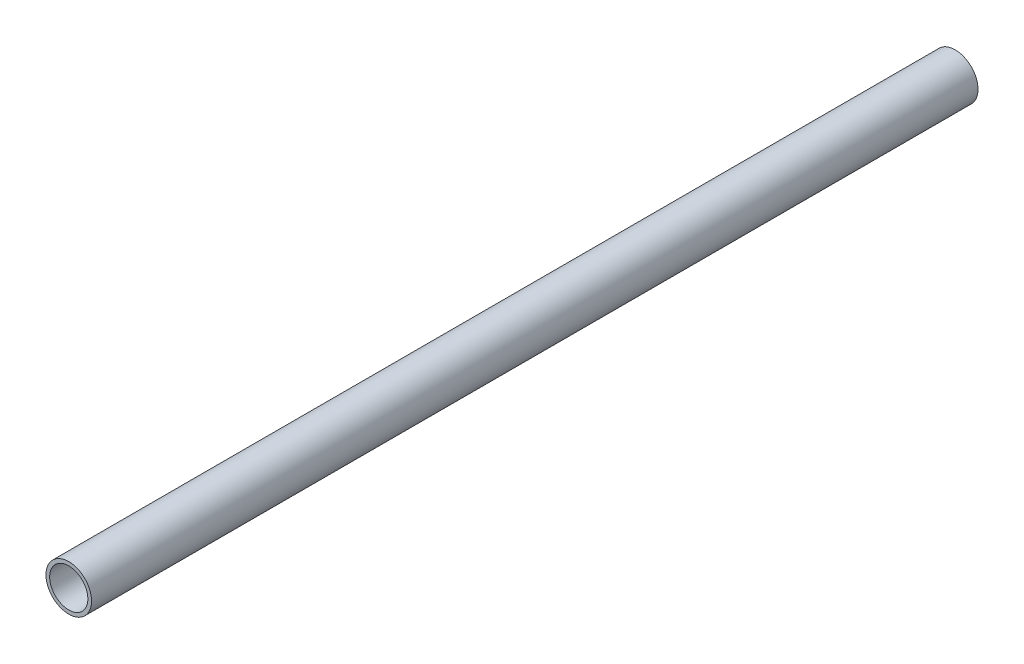
ISO-10303-21;
HEADER;
FILE_DESCRIPTION(('STEP AP214'),'2;1');
FILE_NAME('part.step','',(''),(''),'','','');
FILE_SCHEMA(('AUTOMOTIVE_DESIGN { 1 0 10303 214 1 1 1 1 }'));
ENDSEC;
DATA;
#1=APPLICATION_CONTEXT('core data for automotive mechanical design processes');
#2=APPLICATION_PROTOCOL_DEFINITION('international standard','automotive_design',2000,#1);
#3=PRODUCT_CONTEXT('',#1,'mechanical');
#4=PRODUCT('Part','Part','',(#3));
#5=PRODUCT_RELATED_PRODUCT_CATEGORY('part','',(#4));
#6=PRODUCT_DEFINITION_FORMATION('','',#4);
#7=PRODUCT_DEFINITION_CONTEXT('part definition',#1,'design');
#8=PRODUCT_DEFINITION('design','',#6,#7);
#9=PRODUCT_DEFINITION_SHAPE('','',#8);
#10=(LENGTH_UNIT() NAMED_UNIT(*) SI_UNIT(.MILLI.,.METRE.));
#11=(NAMED_UNIT(*) PLANE_ANGLE_UNIT() SI_UNIT($,.RADIAN.));
#12=(NAMED_UNIT(*) SI_UNIT($,.STERADIAN.) SOLID_ANGLE_UNIT());
#13=UNCERTAINTY_MEASURE_WITH_UNIT(LENGTH_MEASURE(1.E-05),#10,'distance_accuracy_value','');
#14=(GEOMETRIC_REPRESENTATION_CONTEXT(3) GLOBAL_UNCERTAINTY_ASSIGNED_CONTEXT((#13)) GLOBAL_UNIT_ASSIGNED_CONTEXT((#10,
#11,#12)) REPRESENTATION_CONTEXT('',''));
#15=CARTESIAN_POINT('',(0.,0.,0.));
#16=DIRECTION('',(0.,0.,1.));
#17=DIRECTION('',(1.,0.,0.));
#18=AXIS2_PLACEMENT_3D('',#15,#16,#17);
#19=CARTESIAN_POINT('',(0.,0.,-33.3350793903586));
#20=DIRECTION('',(0.,0.,1.));
#21=DIRECTION('',(1.,0.,0.));
#22=AXIS2_PLACEMENT_3D('',#19,#20,#21);
#23=CYLINDRICAL_SURFACE('',#22,8.35);
#24=CARTESIAN_POINT('',(0.,0.,-9.71771289872786));
#25=DIRECTION('',(0.,0.,-1.));
#26=DIRECTION('',(-1.,0.,0.));
#27=AXIS2_PLACEMENT_3D('',#24,#25,#26);
#28=CIRCLE('',#27,8.35);
#29=CARTESIAN_POINT('',(-8.35,0.,-9.71771289872784));
#30=VERTEX_POINT('',#29);
#31=EDGE_CURVE('E37',#30,#30,#28,.F.);
#32=ORIENTED_EDGE('',*,*,#31,.T.);
#33=EDGE_LOOP('',(#32));
#34=FACE_BOUND('',#33,.T.);
#35=CARTESIAN_POINT('',(0.,0.,315.));
#36=DIRECTION('',(0.,0.,1.));
#37=DIRECTION('',(1.,0.,0.));
#38=AXIS2_PLACEMENT_3D('',#35,#36,#37);
#39=CIRCLE('',#38,8.35);
#40=CARTESIAN_POINT('',(8.35,0.,315.));
#41=VERTEX_POINT('',#40);
#42=EDGE_CURVE('E44',#41,#41,#39,.T.);
#43=ORIENTED_EDGE('',*,*,#42,.F.);
#44=EDGE_LOOP('',(#43));
#45=FACE_BOUND('',#44,.T.);
#46=ADVANCED_FACE('F33',(#34,#45),#23,.T.);
#47=CARTESIAN_POINT('',(0.,0.,-33.3350793903586));
#48=DIRECTION('',(0.,0.,1.));
#49=DIRECTION('',(1.,0.,0.));
#50=AXIS2_PLACEMENT_3D('',#47,#48,#49);
#51=CYLINDRICAL_SURFACE('',#50,7.);
#52=CARTESIAN_POINT('',(0.,0.,-9.71771289872786));
#53=DIRECTION('',(0.,0.,-1.));
#54=DIRECTION('',(-1.,0.,0.));
#55=AXIS2_PLACEMENT_3D('',#52,#53,#54);
#56=CIRCLE('',#55,7.);
#57=CARTESIAN_POINT('',(-7.,0.,-9.71771289872785));
#58=VERTEX_POINT('',#57);
#59=EDGE_CURVE('E10',#58,#58,#56,.F.);
#60=ORIENTED_EDGE('',*,*,#59,.F.);
#61=EDGE_LOOP('',(#60));
#62=FACE_BOUND('',#61,.T.);
#63=CARTESIAN_POINT('',(0.,0.,315.));
#64=DIRECTION('',(0.,0.,1.));
#65=DIRECTION('',(1.,0.,0.));
#66=AXIS2_PLACEMENT_3D('',#63,#64,#65);
#67=CIRCLE('',#66,7.);
#68=CARTESIAN_POINT('',(7.,0.,315.));
#69=VERTEX_POINT('',#68);
#70=EDGE_CURVE('E48',#69,#69,#67,.T.);
#71=ORIENTED_EDGE('',*,*,#70,.T.);
#72=EDGE_LOOP('',(#71));
#73=FACE_BOUND('',#72,.T.);
#74=ADVANCED_FACE('F52',(#62,#73),#51,.F.);
#75=CARTESIAN_POINT('',(1.59487100012935,6.14645316364994,-9.71771289872786));
#76=DIRECTION('',(0.,0.,-1.));
#77=DIRECTION('',(-0.967945380102432,0.25116078742184,0.));
#78=AXIS2_PLACEMENT_3D('',#75,#76,#77);
#79=PLANE('',#78);
#80=ORIENTED_EDGE('',*,*,#31,.F.);
#81=EDGE_LOOP('',(#80));
#82=FACE_BOUND('',#81,.T.);
#83=ORIENTED_EDGE('',*,*,#59,.T.);
#84=EDGE_LOOP('',(#83));
#85=FACE_BOUND('',#84,.T.);
#86=ADVANCED_FACE('F35',(#82,#85),#79,.T.);
#87=CARTESIAN_POINT('',(0.,0.,315.));
#88=DIRECTION('',(0.,0.,1.));
#89=DIRECTION('',(1.,0.,0.));
#90=AXIS2_PLACEMENT_3D('',#87,#88,#89);
#91=PLANE('',#90);
#92=ORIENTED_EDGE('',*,*,#42,.T.);
#93=EDGE_LOOP('',(#92));
#94=FACE_BOUND('',#93,.T.);
#95=ORIENTED_EDGE('',*,*,#70,.F.);
#96=EDGE_LOOP('',(#95));
#97=FACE_BOUND('',#96,.T.);
#98=ADVANCED_FACE('F54',(#94,#97),#91,.T.);
#99=CLOSED_SHELL('',(#46,#74,#86,#98));
#100=MANIFOLD_SOLID_BREP('B2',#99);
#101=ADVANCED_BREP_SHAPE_REPRESENTATION('',(#18,#100),#14);
#102=SHAPE_DEFINITION_REPRESENTATION(#9,#101);
ENDSEC;
END-ISO-10303-21;
